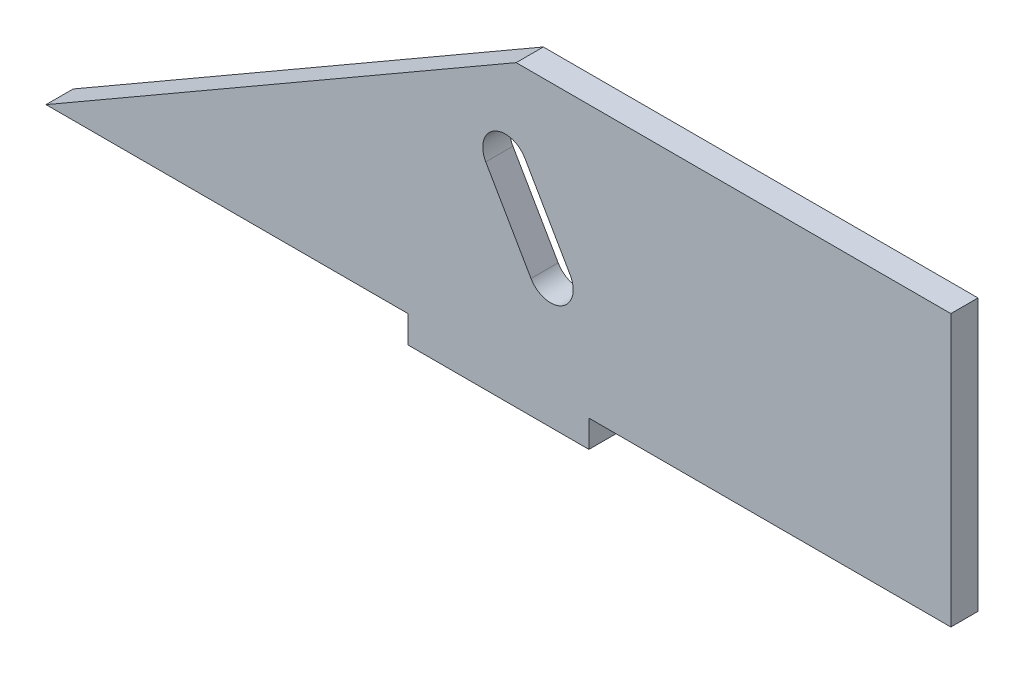
ISO-10303-21;
HEADER;
FILE_DESCRIPTION(('STEP AP214'),'2;1');
FILE_NAME('part.step','',(''),(''),'','','');
FILE_SCHEMA(('AUTOMOTIVE_DESIGN { 1 0 10303 214 1 1 1 1 }'));
ENDSEC;
DATA;
#1=APPLICATION_CONTEXT('core data for automotive mechanical design processes');
#2=APPLICATION_PROTOCOL_DEFINITION('international standard','automotive_design',2000,#1);
#3=PRODUCT_CONTEXT('',#1,'mechanical');
#4=PRODUCT('Part','Part','',(#3));
#5=PRODUCT_RELATED_PRODUCT_CATEGORY('part','',(#4));
#6=PRODUCT_DEFINITION_FORMATION('','',#4);
#7=PRODUCT_DEFINITION_CONTEXT('part definition',#1,'design');
#8=PRODUCT_DEFINITION('design','',#6,#7);
#9=PRODUCT_DEFINITION_SHAPE('','',#8);
#10=(LENGTH_UNIT() NAMED_UNIT(*) SI_UNIT(.MILLI.,.METRE.));
#11=(NAMED_UNIT(*) PLANE_ANGLE_UNIT() SI_UNIT($,.RADIAN.));
#12=(NAMED_UNIT(*) SI_UNIT($,.STERADIAN.) SOLID_ANGLE_UNIT());
#13=UNCERTAINTY_MEASURE_WITH_UNIT(LENGTH_MEASURE(1.E-05),#10,'distance_accuracy_value','');
#14=(GEOMETRIC_REPRESENTATION_CONTEXT(3) GLOBAL_UNCERTAINTY_ASSIGNED_CONTEXT((#13)) GLOBAL_UNIT_ASSIGNED_CONTEXT((#10,
#11,#12)) REPRESENTATION_CONTEXT('',''));
#15=CARTESIAN_POINT('',(0.,0.,0.));
#16=DIRECTION('',(0.,0.,1.));
#17=DIRECTION('',(1.,0.,0.));
#18=AXIS2_PLACEMENT_3D('',#15,#16,#17);
#19=CARTESIAN_POINT('',(-10.,-13.,3.));
#20=DIRECTION('',(0.,1.,0.));
#21=DIRECTION('',(-1.,0.,0.));
#22=AXIS2_PLACEMENT_3D('',#19,#20,#21);
#23=PLANE('',#22);
#24=DIRECTION('',(1.,0.,0.));
#25=VECTOR('',#24,1.);
#26=CARTESIAN_POINT('',(-10.,-13.,0.));
#27=LINE('',#26,#25);
#28=CARTESIAN_POINT('',(-50.,-13.,0.));
#29=VERTEX_POINT('',#28);
#30=CARTESIAN_POINT('',(-10.,-13.,0.));
#31=VERTEX_POINT('',#30);
#32=EDGE_CURVE('E170',#29,#31,#27,.T.);
#33=ORIENTED_EDGE('',*,*,#32,.T.);
#34=DIRECTION('',(0.,0.,-1.));
#35=VECTOR('',#34,1.);
#36=CARTESIAN_POINT('',(-10.,-13.,3.));
#37=LINE('',#36,#35);
#38=CARTESIAN_POINT('',(-10.,-13.,3.));
#39=VERTEX_POINT('',#38);
#40=EDGE_CURVE('E234',#39,#31,#37,.T.);
#41=ORIENTED_EDGE('',*,*,#40,.F.);
#42=DIRECTION('',(1.,0.,0.));
#43=VECTOR('',#42,1.);
#44=CARTESIAN_POINT('',(-10.,-13.,3.));
#45=LINE('',#44,#43);
#46=CARTESIAN_POINT('',(-50.,-13.,3.));
#47=VERTEX_POINT('',#46);
#48=EDGE_CURVE('E171',#47,#39,#45,.T.);
#49=ORIENTED_EDGE('',*,*,#48,.F.);
#50=DIRECTION('',(0.,0.,-1.));
#51=VECTOR('',#50,1.);
#52=CARTESIAN_POINT('',(-50.,-13.,3.));
#53=LINE('',#52,#51);
#54=EDGE_CURVE('E238',#47,#29,#53,.T.);
#55=ORIENTED_EDGE('',*,*,#54,.T.);
#56=EDGE_LOOP('',(#33,#41,#49,#55));
#57=FACE_BOUND('',#56,.T.);
#58=ADVANCED_FACE('F39',(#57),#23,.F.);
#59=CARTESIAN_POINT('',(-10.,-13.,3.));
#60=DIRECTION('',(1.,0.,0.));
#61=DIRECTION('',(0.,0.,-1.));
#62=AXIS2_PLACEMENT_3D('',#59,#60,#61);
#63=PLANE('',#62);
#64=DIRECTION('',(0.,-1.,0.));
#65=VECTOR('',#64,1.);
#66=CARTESIAN_POINT('',(-10.,-13.,0.));
#67=LINE('',#66,#65);
#68=CARTESIAN_POINT('',(-10.,-16.,0.));
#69=VERTEX_POINT('',#68);
#70=EDGE_CURVE('E197',#31,#69,#67,.T.);
#71=ORIENTED_EDGE('',*,*,#70,.T.);
#72=DIRECTION('',(0.,0.,-1.));
#73=VECTOR('',#72,1.);
#74=CARTESIAN_POINT('',(-10.,-16.,3.));
#75=LINE('',#74,#73);
#76=CARTESIAN_POINT('',(-10.,-16.,3.));
#77=VERTEX_POINT('',#76);
#78=EDGE_CURVE('E230',#77,#69,#75,.T.);
#79=ORIENTED_EDGE('',*,*,#78,.F.);
#80=DIRECTION('',(0.,-1.,0.));
#81=VECTOR('',#80,1.);
#82=CARTESIAN_POINT('',(-10.,-13.,3.));
#83=LINE('',#82,#81);
#84=EDGE_CURVE('E174',#39,#77,#83,.T.);
#85=ORIENTED_EDGE('',*,*,#84,.F.);
#86=ORIENTED_EDGE('',*,*,#40,.T.);
#87=EDGE_LOOP('',(#71,#79,#85,#86));
#88=FACE_BOUND('',#87,.T.);
#89=ADVANCED_FACE('F271',(#88),#63,.F.);
#90=CARTESIAN_POINT('',(-10.,-16.,3.));
#91=DIRECTION('',(0.,1.,0.));
#92=DIRECTION('',(0.,0.,1.));
#93=AXIS2_PLACEMENT_3D('',#90,#91,#92);
#94=PLANE('',#93);
#95=DIRECTION('',(1.,0.,0.));
#96=VECTOR('',#95,1.);
#97=CARTESIAN_POINT('',(-10.,-16.,0.));
#98=LINE('',#97,#96);
#99=CARTESIAN_POINT('',(10.,-16.,0.));
#100=VERTEX_POINT('',#99);
#101=EDGE_CURVE('E200',#69,#100,#98,.T.);
#102=ORIENTED_EDGE('',*,*,#101,.T.);
#103=DIRECTION('',(0.,0.,-1.));
#104=VECTOR('',#103,1.);
#105=CARTESIAN_POINT('',(10.,-16.,3.));
#106=LINE('',#105,#104);
#107=CARTESIAN_POINT('',(10.,-16.,3.));
#108=VERTEX_POINT('',#107);
#109=EDGE_CURVE('E226',#108,#100,#106,.T.);
#110=ORIENTED_EDGE('',*,*,#109,.F.);
#111=DIRECTION('',(1.,0.,0.));
#112=VECTOR('',#111,1.);
#113=CARTESIAN_POINT('',(-10.,-16.,3.));
#114=LINE('',#113,#112);
#115=EDGE_CURVE('E178',#77,#108,#114,.T.);
#116=ORIENTED_EDGE('',*,*,#115,.F.);
#117=ORIENTED_EDGE('',*,*,#78,.T.);
#118=EDGE_LOOP('',(#102,#110,#116,#117));
#119=FACE_BOUND('',#118,.T.);
#120=ADVANCED_FACE('F276',(#119),#94,.F.);
#121=CARTESIAN_POINT('',(10.,-16.,3.));
#122=DIRECTION('',(-1.,0.,0.));
#123=DIRECTION('',(0.,-1.,0.));
#124=AXIS2_PLACEMENT_3D('',#121,#122,#123);
#125=PLANE('',#124);
#126=DIRECTION('',(0.,1.,0.));
#127=VECTOR('',#126,1.);
#128=CARTESIAN_POINT('',(10.,-16.,0.));
#129=LINE('',#128,#127);
#130=CARTESIAN_POINT('',(10.,-13.,0.));
#131=VERTEX_POINT('',#130);
#132=EDGE_CURVE('E203',#100,#131,#129,.T.);
#133=ORIENTED_EDGE('',*,*,#132,.T.);
#134=DIRECTION('',(0.,0.,-1.));
#135=VECTOR('',#134,1.);
#136=CARTESIAN_POINT('',(10.,-13.,3.));
#137=LINE('',#136,#135);
#138=CARTESIAN_POINT('',(10.,-13.,3.));
#139=VERTEX_POINT('',#138);
#140=EDGE_CURVE('E222',#139,#131,#137,.T.);
#141=ORIENTED_EDGE('',*,*,#140,.F.);
#142=DIRECTION('',(0.,1.,0.));
#143=VECTOR('',#142,1.);
#144=CARTESIAN_POINT('',(10.,-16.,3.));
#145=LINE('',#144,#143);
#146=EDGE_CURVE('E181',#108,#139,#145,.T.);
#147=ORIENTED_EDGE('',*,*,#146,.F.);
#148=ORIENTED_EDGE('',*,*,#109,.T.);
#149=EDGE_LOOP('',(#133,#141,#147,#148));
#150=FACE_BOUND('',#149,.T.);
#151=ADVANCED_FACE('F292',(#150),#125,.F.);
#152=CARTESIAN_POINT('',(50.,-13.,3.));
#153=DIRECTION('',(0.,1.,0.));
#154=DIRECTION('',(-1.,0.,0.));
#155=AXIS2_PLACEMENT_3D('',#152,#153,#154);
#156=PLANE('',#155);
#157=DIRECTION('',(1.,0.,0.));
#158=VECTOR('',#157,1.);
#159=CARTESIAN_POINT('',(50.,-13.,0.));
#160=LINE('',#159,#158);
#161=CARTESIAN_POINT('',(50.,-13.,0.));
#162=VERTEX_POINT('',#161);
#163=EDGE_CURVE('E206',#131,#162,#160,.T.);
#164=ORIENTED_EDGE('',*,*,#163,.T.);
#165=DIRECTION('',(0.,0.,-1.));
#166=VECTOR('',#165,1.);
#167=CARTESIAN_POINT('',(50.,-13.,3.));
#168=LINE('',#167,#166);
#169=CARTESIAN_POINT('',(50.,-13.,3.));
#170=VERTEX_POINT('',#169);
#171=EDGE_CURVE('E218',#170,#162,#168,.T.);
#172=ORIENTED_EDGE('',*,*,#171,.F.);
#173=DIRECTION('',(1.,0.,0.));
#174=VECTOR('',#173,1.);
#175=CARTESIAN_POINT('',(50.,-13.,3.));
#176=LINE('',#175,#174);
#177=EDGE_CURVE('E184',#139,#170,#176,.T.);
#178=ORIENTED_EDGE('',*,*,#177,.F.);
#179=ORIENTED_EDGE('',*,*,#140,.T.);
#180=EDGE_LOOP('',(#164,#172,#178,#179));
#181=FACE_BOUND('',#180,.T.);
#182=ADVANCED_FACE('F307',(#181),#156,.F.);
#183=CARTESIAN_POINT('',(50.,-13.,3.));
#184=DIRECTION('',(-1.,0.,0.));
#185=DIRECTION('',(0.,0.,1.));
#186=AXIS2_PLACEMENT_3D('',#183,#184,#185);
#187=PLANE('',#186);
#188=DIRECTION('',(0.,1.,0.));
#189=VECTOR('',#188,1.);
#190=CARTESIAN_POINT('',(50.,-13.,0.));
#191=LINE('',#190,#189);
#192=CARTESIAN_POINT('',(50.,17.,0.));
#193=VERTEX_POINT('',#192);
#194=EDGE_CURVE('E209',#162,#193,#191,.T.);
#195=ORIENTED_EDGE('',*,*,#194,.T.);
#196=DIRECTION('',(0.,0.,-1.));
#197=VECTOR('',#196,1.);
#198=CARTESIAN_POINT('',(50.,17.,3.));
#199=LINE('',#198,#197);
#200=CARTESIAN_POINT('',(50.,17.,3.));
#201=VERTEX_POINT('',#200);
#202=EDGE_CURVE('E194',#201,#193,#199,.T.);
#203=ORIENTED_EDGE('',*,*,#202,.F.);
#204=DIRECTION('',(0.,1.,0.));
#205=VECTOR('',#204,1.);
#206=CARTESIAN_POINT('',(50.,-13.,3.));
#207=LINE('',#206,#205);
#208=EDGE_CURVE('E187',#170,#201,#207,.T.);
#209=ORIENTED_EDGE('',*,*,#208,.F.);
#210=ORIENTED_EDGE('',*,*,#171,.T.);
#211=EDGE_LOOP('',(#195,#203,#209,#210));
#212=FACE_BOUND('',#211,.T.);
#213=ADVANCED_FACE('F304',(#212),#187,.F.);
#214=CARTESIAN_POINT('',(50.,17.,3.));
#215=DIRECTION('',(0.,-1.,0.));
#216=DIRECTION('',(1.,0.,0.));
#217=AXIS2_PLACEMENT_3D('',#214,#215,#216);
#218=PLANE('',#217);
#219=DIRECTION('',(-1.,0.,0.));
#220=VECTOR('',#219,1.);
#221=CARTESIAN_POINT('',(50.,17.,0.));
#222=LINE('',#221,#220);
#223=CARTESIAN_POINT('',(1.96152422706571,17.,0.));
#224=VERTEX_POINT('',#223);
#225=EDGE_CURVE('E175',#193,#224,#222,.T.);
#226=ORIENTED_EDGE('',*,*,#225,.T.);
#227=DIRECTION('',(0.,0.,1.));
#228=VECTOR('',#227,1.);
#229=CARTESIAN_POINT('',(1.96152422706573,17.,-1.));
#230=LINE('',#229,#228);
#231=CARTESIAN_POINT('',(1.96152422706573,17.,3.));
#232=VERTEX_POINT('',#231);
#233=EDGE_CURVE('E166',#224,#232,#230,.T.);
#234=ORIENTED_EDGE('',*,*,#233,.T.);
#235=DIRECTION('',(-1.,0.,0.));
#236=VECTOR('',#235,1.);
#237=CARTESIAN_POINT('',(50.,17.,3.));
#238=LINE('',#237,#236);
#239=EDGE_CURVE('E190',#201,#232,#238,.T.);
#240=ORIENTED_EDGE('',*,*,#239,.F.);
#241=ORIENTED_EDGE('',*,*,#202,.T.);
#242=EDGE_LOOP('',(#226,#234,#240,#241));
#243=FACE_BOUND('',#242,.T.);
#244=ADVANCED_FACE('F299',(#243),#218,.F.);
#245=CARTESIAN_POINT('',(0.,0.,3.));
#246=DIRECTION('',(0.,0.,1.));
#247=DIRECTION('',(1.,0.,0.));
#248=AXIS2_PLACEMENT_3D('',#245,#246,#247);
#249=PLANE('',#248);
#250=CARTESIAN_POINT('',(0.765371804359254,7.07179676972423,3.));
#251=DIRECTION('',(0.,0.,1.));
#252=DIRECTION('',(1.,0.,0.));
#253=AXIS2_PLACEMENT_3D('',#250,#251,#252);
#254=CIRCLE('',#253,2.5);
#255=CARTESIAN_POINT('',(2.93043531382035,8.32179676972423,3.));
#256=VERTEX_POINT('',#255);
#257=CARTESIAN_POINT('',(-1.39969170510184,5.82179676972423,3.));
#258=VERTEX_POINT('',#257);
#259=EDGE_CURVE('E54',#256,#258,#254,.T.);
#260=ORIENTED_EDGE('',*,*,#259,.F.);
#261=DIRECTION('',(-0.5,0.866025403784439,0.));
#262=VECTOR('',#261,1.);
#263=CARTESIAN_POINT('',(7.93043531382035,-0.338457268120155,3.));
#264=LINE('',#263,#262);
#265=CARTESIAN_POINT('',(7.93043531382035,-0.338457268120155,3.));
#266=VERTEX_POINT('',#265);
#267=EDGE_CURVE('E149',#266,#256,#264,.T.);
#268=ORIENTED_EDGE('',*,*,#267,.F.);
#269=CARTESIAN_POINT('',(5.76537180435925,-1.58845726812015,3.));
#270=DIRECTION('',(0.,0.,1.));
#271=DIRECTION('',(1.,0.,0.));
#272=AXIS2_PLACEMENT_3D('',#269,#270,#271);
#273=CIRCLE('',#272,2.5);
#274=CARTESIAN_POINT('',(3.60030829489815,-2.83845726812015,3.));
#275=VERTEX_POINT('',#274);
#276=EDGE_CURVE('E131',#275,#266,#273,.T.);
#277=ORIENTED_EDGE('',*,*,#276,.F.);
#278=DIRECTION('',(0.5,-0.866025403784439,0.));
#279=VECTOR('',#278,1.);
#280=CARTESIAN_POINT('',(3.60030829489815,-2.83845726812015,3.));
#281=LINE('',#280,#279);
#282=EDGE_CURVE('E141',#258,#275,#281,.T.);
#283=ORIENTED_EDGE('',*,*,#282,.F.);
#284=EDGE_LOOP('',(#260,#268,#277,#283));
#285=FACE_BOUND('',#284,.T.);
#286=DIRECTION('',(0.866025403784436,0.500000000000004,0.));
#287=VECTOR('',#286,1.);
#288=CARTESIAN_POINT('',(-50.,-13.,3.));
#289=LINE('',#288,#287);
#290=EDGE_CURVE('E159',#47,#232,#289,.T.);
#291=ORIENTED_EDGE('',*,*,#290,.F.);
#292=ORIENTED_EDGE('',*,*,#48,.T.);
#293=ORIENTED_EDGE('',*,*,#84,.T.);
#294=ORIENTED_EDGE('',*,*,#115,.T.);
#295=ORIENTED_EDGE('',*,*,#146,.T.);
#296=ORIENTED_EDGE('',*,*,#177,.T.);
#297=ORIENTED_EDGE('',*,*,#208,.T.);
#298=ORIENTED_EDGE('',*,*,#239,.T.);
#299=EDGE_LOOP('',(#291,#292,#293,#294,#295,#296,#297,#298));
#300=FACE_BOUND('',#299,.T.);
#301=ADVANCED_FACE('F146',(#285,#300),#249,.T.);
#302=CARTESIAN_POINT('',(0.,0.,0.));
#303=DIRECTION('',(0.,0.,1.));
#304=DIRECTION('',(1.,0.,0.));
#305=AXIS2_PLACEMENT_3D('',#302,#303,#304);
#306=PLANE('',#305);
#307=DIRECTION('',(-0.5,0.866025403784439,0.));
#308=VECTOR('',#307,1.);
#309=CARTESIAN_POINT('',(5.8012701892215,3.34936490538878,0.));
#310=LINE('',#309,#308);
#311=CARTESIAN_POINT('',(7.93043531382035,-0.338457268120155,0.));
#312=VERTEX_POINT('',#311);
#313=CARTESIAN_POINT('',(2.93043531382035,8.32179676972423,0.));
#314=VERTEX_POINT('',#313);
#315=EDGE_CURVE('E47',#312,#314,#310,.T.);
#316=ORIENTED_EDGE('',*,*,#315,.T.);
#317=CARTESIAN_POINT('',(0.765371804359254,7.07179676972423,0.));
#318=DIRECTION('',(0.,0.,1.));
#319=DIRECTION('',(1.,0.,0.));
#320=AXIS2_PLACEMENT_3D('',#317,#318,#319);
#321=CIRCLE('',#320,2.5);
#322=CARTESIAN_POINT('',(-1.39969170510184,5.82179676972423,0.));
#323=VERTEX_POINT('',#322);
#324=EDGE_CURVE('E11',#314,#323,#321,.T.);
#325=ORIENTED_EDGE('',*,*,#324,.T.);
#326=DIRECTION('',(0.5,-0.866025403784439,0.));
#327=VECTOR('',#326,1.);
#328=CARTESIAN_POINT('',(1.4711431702993,0.849364905388781,0.));
#329=LINE('',#328,#327);
#330=CARTESIAN_POINT('',(3.60030829489815,-2.83845726812015,0.));
#331=VERTEX_POINT('',#330);
#332=EDGE_CURVE('E246',#323,#331,#329,.T.);
#333=ORIENTED_EDGE('',*,*,#332,.T.);
#334=CARTESIAN_POINT('',(5.76537180435925,-1.58845726812015,0.));
#335=DIRECTION('',(0.,0.,1.));
#336=DIRECTION('',(1.,0.,0.));
#337=AXIS2_PLACEMENT_3D('',#334,#335,#336);
#338=CIRCLE('',#337,2.5);
#339=EDGE_CURVE('E134',#331,#312,#338,.T.);
#340=ORIENTED_EDGE('',*,*,#339,.T.);
#341=EDGE_LOOP('',(#316,#325,#333,#340));
#342=FACE_BOUND('',#341,.T.);
#343=ORIENTED_EDGE('',*,*,#32,.F.);
#344=DIRECTION('',(0.866025403784436,0.500000000000004,0.));
#345=VECTOR('',#344,1.);
#346=CARTESIAN_POINT('',(-6.87083487540133,11.9006350946111,0.));
#347=LINE('',#346,#345);
#348=EDGE_CURVE('E242',#29,#224,#347,.T.);
#349=ORIENTED_EDGE('',*,*,#348,.T.);
#350=ORIENTED_EDGE('',*,*,#225,.F.);
#351=ORIENTED_EDGE('',*,*,#194,.F.);
#352=ORIENTED_EDGE('',*,*,#163,.F.);
#353=ORIENTED_EDGE('',*,*,#132,.F.);
#354=ORIENTED_EDGE('',*,*,#101,.F.);
#355=ORIENTED_EDGE('',*,*,#70,.F.);
#356=EDGE_LOOP('',(#343,#349,#350,#351,#352,#353,#354,#355));
#357=FACE_BOUND('',#356,.T.);
#358=ADVANCED_FACE('F253',(#342,#357),#306,.F.);
#359=CARTESIAN_POINT('',(-50.,-13.,-1.));
#360=DIRECTION('',(0.500000000000004,-0.866025403784436,0.));
#361=DIRECTION('',(0.866025403784436,0.500000000000004,0.));
#362=AXIS2_PLACEMENT_3D('',#359,#360,#361);
#363=PLANE('',#362);
#364=ORIENTED_EDGE('',*,*,#54,.F.);
#365=ORIENTED_EDGE('',*,*,#290,.T.);
#366=ORIENTED_EDGE('',*,*,#233,.F.);
#367=ORIENTED_EDGE('',*,*,#348,.F.);
#368=EDGE_LOOP('',(#364,#365,#366,#367));
#369=FACE_BOUND('',#368,.T.);
#370=ADVANCED_FACE('F260',(#369),#363,.F.);
#371=CARTESIAN_POINT('',(0.765371804359254,7.07179676972423,-1.));
#372=DIRECTION('',(0.,0.,1.));
#373=DIRECTION('',(1.,0.,0.));
#374=AXIS2_PLACEMENT_3D('',#371,#372,#373);
#375=CYLINDRICAL_SURFACE('',#374,2.5);
#376=DIRECTION('',(0.,0.,1.));
#377=VECTOR('',#376,1.);
#378=CARTESIAN_POINT('',(2.93043531382035,8.32179676972423,-1.));
#379=LINE('',#378,#377);
#380=EDGE_CURVE('E156',#314,#256,#379,.T.);
#381=ORIENTED_EDGE('',*,*,#380,.T.);
#382=ORIENTED_EDGE('',*,*,#259,.T.);
#383=DIRECTION('',(0.,0.,1.));
#384=VECTOR('',#383,1.);
#385=CARTESIAN_POINT('',(-1.39969170510184,5.82179676972423,-1.));
#386=LINE('',#385,#384);
#387=EDGE_CURVE('E138',#323,#258,#386,.T.);
#388=ORIENTED_EDGE('',*,*,#387,.F.);
#389=ORIENTED_EDGE('',*,*,#324,.F.);
#390=EDGE_LOOP('',(#381,#382,#388,#389));
#391=FACE_BOUND('',#390,.T.);
#392=ADVANCED_FACE('F258',(#391),#375,.F.);
#393=CARTESIAN_POINT('',(7.93043531382035,-0.338457268120155,-1.));
#394=DIRECTION('',(0.866025403784439,0.5,0.));
#395=DIRECTION('',(-0.5,0.866025403784439,0.));
#396=AXIS2_PLACEMENT_3D('',#393,#394,#395);
#397=PLANE('',#396);
#398=DIRECTION('',(0.,0.,1.));
#399=VECTOR('',#398,1.);
#400=CARTESIAN_POINT('',(7.93043531382035,-0.338457268120155,-1.));
#401=LINE('',#400,#399);
#402=EDGE_CURVE('E137',#312,#266,#401,.T.);
#403=ORIENTED_EDGE('',*,*,#402,.T.);
#404=ORIENTED_EDGE('',*,*,#267,.T.);
#405=ORIENTED_EDGE('',*,*,#380,.F.);
#406=ORIENTED_EDGE('',*,*,#315,.F.);
#407=EDGE_LOOP('',(#403,#404,#405,#406));
#408=FACE_BOUND('',#407,.T.);
#409=ADVANCED_FACE('F257',(#408),#397,.F.);
#410=CARTESIAN_POINT('',(5.76537180435925,-1.58845726812015,-1.));
#411=DIRECTION('',(0.,0.,1.));
#412=DIRECTION('',(1.,0.,0.));
#413=AXIS2_PLACEMENT_3D('',#410,#411,#412);
#414=CYLINDRICAL_SURFACE('',#413,2.5);
#415=DIRECTION('',(0.,0.,1.));
#416=VECTOR('',#415,1.);
#417=CARTESIAN_POINT('',(3.60030829489815,-2.83845726812015,-1.));
#418=LINE('',#417,#416);
#419=EDGE_CURVE('E62',#331,#275,#418,.T.);
#420=ORIENTED_EDGE('',*,*,#419,.T.);
#421=ORIENTED_EDGE('',*,*,#276,.T.);
#422=ORIENTED_EDGE('',*,*,#402,.F.);
#423=ORIENTED_EDGE('',*,*,#339,.F.);
#424=EDGE_LOOP('',(#420,#421,#422,#423));
#425=FACE_BOUND('',#424,.T.);
#426=ADVANCED_FACE('F128',(#425),#414,.F.);
#427=CARTESIAN_POINT('',(3.60030829489815,-2.83845726812015,-1.));
#428=DIRECTION('',(-0.866025403784439,-0.5,0.));
#429=DIRECTION('',(0.5,-0.866025403784439,0.));
#430=AXIS2_PLACEMENT_3D('',#427,#428,#429);
#431=PLANE('',#430);
#432=ORIENTED_EDGE('',*,*,#387,.T.);
#433=ORIENTED_EDGE('',*,*,#282,.T.);
#434=ORIENTED_EDGE('',*,*,#419,.F.);
#435=ORIENTED_EDGE('',*,*,#332,.F.);
#436=EDGE_LOOP('',(#432,#433,#434,#435));
#437=FACE_BOUND('',#436,.T.);
#438=ADVANCED_FACE('F142',(#437),#431,.F.);
#439=CLOSED_SHELL('',(#58,#89,#120,#151,#182,#213,#244,#301,#358,#370,#392,#409,#426,#438));
#440=MANIFOLD_SOLID_BREP('B2',#439);
#441=ADVANCED_BREP_SHAPE_REPRESENTATION('',(#18,#440),#14);
#442=SHAPE_DEFINITION_REPRESENTATION(#9,#441);
ENDSEC;
END-ISO-10303-21;
